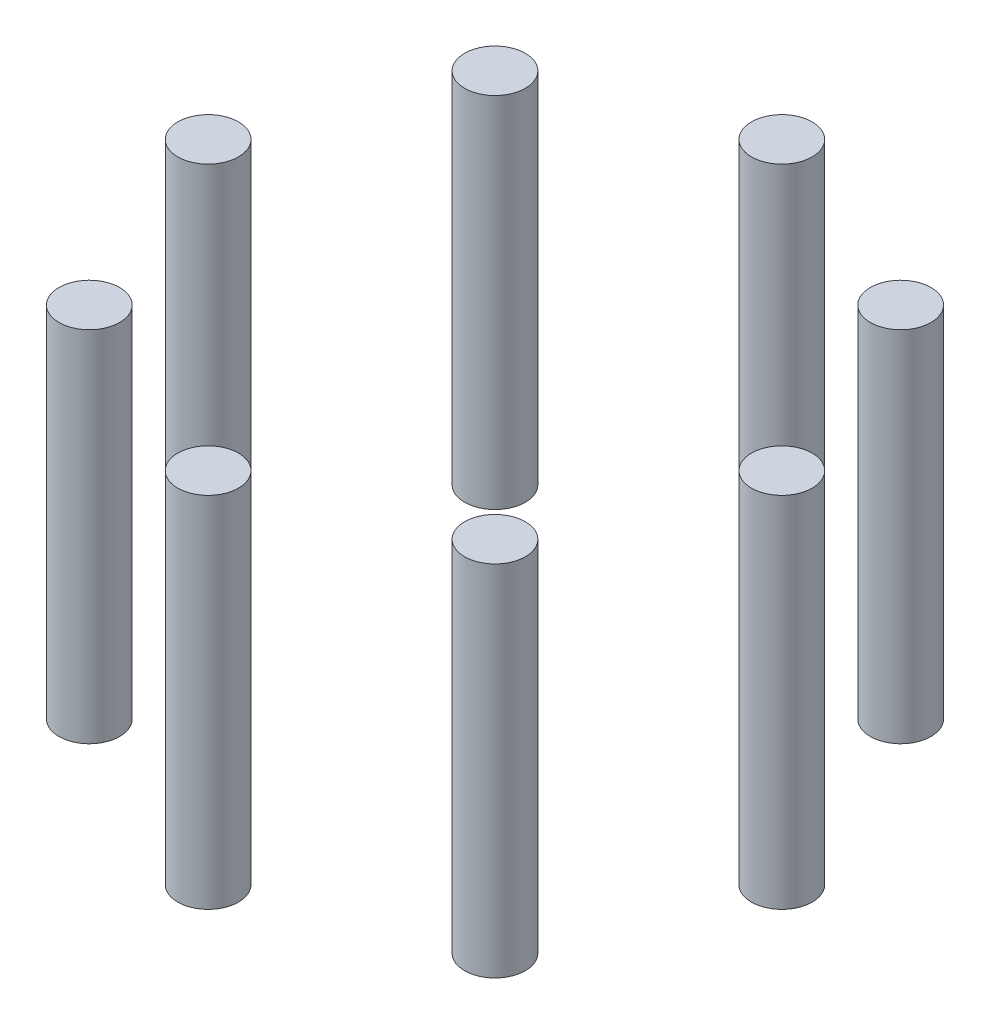
ISO-10303-21;
HEADER;
FILE_DESCRIPTION(('STEP AP214'),'2;1');
FILE_NAME('part.step','',(''),(''),'','','');
FILE_SCHEMA(('AUTOMOTIVE_DESIGN { 1 0 10303 214 1 1 1 1 }'));
ENDSEC;
DATA;
#1=APPLICATION_CONTEXT('core data for automotive mechanical design processes');
#2=APPLICATION_PROTOCOL_DEFINITION('international standard','automotive_design',2000,#1);
#3=PRODUCT_CONTEXT('',#1,'mechanical');
#4=PRODUCT('Part','Part','',(#3));
#5=PRODUCT_RELATED_PRODUCT_CATEGORY('part','',(#4));
#6=PRODUCT_DEFINITION_FORMATION('','',#4);
#7=PRODUCT_DEFINITION_CONTEXT('part definition',#1,'design');
#8=PRODUCT_DEFINITION('design','',#6,#7);
#9=PRODUCT_DEFINITION_SHAPE('','',#8);
#10=(LENGTH_UNIT() NAMED_UNIT(*) SI_UNIT(.MILLI.,.METRE.));
#11=(NAMED_UNIT(*) PLANE_ANGLE_UNIT() SI_UNIT($,.RADIAN.));
#12=(NAMED_UNIT(*) SI_UNIT($,.STERADIAN.) SOLID_ANGLE_UNIT());
#13=UNCERTAINTY_MEASURE_WITH_UNIT(LENGTH_MEASURE(1.E-05),#10,'distance_accuracy_value','');
#14=(GEOMETRIC_REPRESENTATION_CONTEXT(3) GLOBAL_UNCERTAINTY_ASSIGNED_CONTEXT((#13)) GLOBAL_UNIT_ASSIGNED_CONTEXT((#10,
#11,#12)) REPRESENTATION_CONTEXT('',''));
#15=CARTESIAN_POINT('',(0.,0.,0.));
#16=DIRECTION('',(0.,0.,1.));
#17=DIRECTION('',(1.,0.,0.));
#18=AXIS2_PLACEMENT_3D('',#15,#16,#17);
#19=CARTESIAN_POINT('',(-5.44671088859529E-13,65.,52.));
#20=DIRECTION('',(0.,-1.,0.));
#21=DIRECTION('',(0.,0.,-1.));
#22=AXIS2_PLACEMENT_3D('',#19,#20,#21);
#23=CYLINDRICAL_SURFACE('',#22,5.49999999999999);
#24=CARTESIAN_POINT('',(-5.44671088859529E-13,65.,52.));
#25=DIRECTION('',(0.,1.,0.));
#26=DIRECTION('',(0.,0.,1.));
#27=AXIS2_PLACEMENT_3D('',#24,#25,#26);
#28=CIRCLE('',#27,5.49999999999999);
#29=CARTESIAN_POINT('',(-5.44671088859529E-13,65.,57.5));
#30=VERTEX_POINT('',#29);
#31=EDGE_CURVE('E48',#30,#30,#28,.T.);
#32=ORIENTED_EDGE('',*,*,#31,.F.);
#33=EDGE_LOOP('',(#32));
#34=FACE_BOUND('',#33,.T.);
#35=CARTESIAN_POINT('',(-5.44671088859529E-13,0.,52.));
#36=DIRECTION('',(0.,1.,0.));
#37=DIRECTION('',(0.,0.,1.));
#38=AXIS2_PLACEMENT_3D('',#35,#36,#37);
#39=CIRCLE('',#38,5.49999999999999);
#40=CARTESIAN_POINT('',(-5.44671088859529E-13,0.,57.5));
#41=VERTEX_POINT('',#40);
#42=EDGE_CURVE('E11',#41,#41,#39,.T.);
#43=ORIENTED_EDGE('',*,*,#42,.T.);
#44=EDGE_LOOP('',(#43));
#45=FACE_BOUND('',#44,.T.);
#46=ADVANCED_FACE('F44',(#34,#45),#23,.T.);
#47=CARTESIAN_POINT('',(-5.44671088859529E-13,65.,52.));
#48=DIRECTION('',(0.,1.,0.));
#49=DIRECTION('',(0.,0.,1.));
#50=AXIS2_PLACEMENT_3D('',#47,#48,#49);
#51=PLANE('',#50);
#52=ORIENTED_EDGE('',*,*,#31,.T.);
#53=EDGE_LOOP('',(#52));
#54=FACE_BOUND('',#53,.T.);
#55=ADVANCED_FACE('F46',(#54),#51,.T.);
#56=CARTESIAN_POINT('',(-5.44671088859529E-13,0.,52.));
#57=DIRECTION('',(0.,1.,0.));
#58=DIRECTION('',(0.,0.,1.));
#59=AXIS2_PLACEMENT_3D('',#56,#57,#58);
#60=PLANE('',#59);
#61=ORIENTED_EDGE('',*,*,#42,.F.);
#62=EDGE_LOOP('',(#61));
#63=FACE_BOUND('',#62,.T.);
#64=ADVANCED_FACE('F63',(#63),#60,.F.);
#65=CLOSED_SHELL('',(#46,#55,#64));
#66=MANIFOLD_SOLID_BREP('B2',#65);
#67=CARTESIAN_POINT('',(36.7695526217001,65.,36.7695526217008));
#68=DIRECTION('',(0.,-1.,0.));
#69=DIRECTION('',(0.,0.,-1.));
#70=AXIS2_PLACEMENT_3D('',#67,#68,#69);
#71=CYLINDRICAL_SURFACE('',#70,5.49999999999999);
#72=CARTESIAN_POINT('',(36.7695526217001,65.,36.7695526217008));
#73=DIRECTION('',(0.,1.,0.));
#74=DIRECTION('',(0.,0.,1.));
#75=AXIS2_PLACEMENT_3D('',#72,#73,#74);
#76=CIRCLE('',#75,5.49999999999999);
#77=CARTESIAN_POINT('',(36.7695526217001,65.,42.2695526217008));
#78=VERTEX_POINT('',#77);
#79=EDGE_CURVE('E103',#78,#78,#76,.T.);
#80=ORIENTED_EDGE('',*,*,#79,.F.);
#81=EDGE_LOOP('',(#80));
#82=FACE_BOUND('',#81,.T.);
#83=CARTESIAN_POINT('',(36.7695526217001,0.,36.7695526217008));
#84=DIRECTION('',(0.,1.,0.));
#85=DIRECTION('',(0.,0.,1.));
#86=AXIS2_PLACEMENT_3D('',#83,#84,#85);
#87=CIRCLE('',#86,5.49999999999999);
#88=CARTESIAN_POINT('',(36.7695526217001,0.,42.2695526217008));
#89=VERTEX_POINT('',#88);
#90=EDGE_CURVE('E43',#89,#89,#87,.T.);
#91=ORIENTED_EDGE('',*,*,#90,.T.);
#92=EDGE_LOOP('',(#91));
#93=FACE_BOUND('',#92,.T.);
#94=ADVANCED_FACE('F99',(#82,#93),#71,.T.);
#95=CARTESIAN_POINT('',(36.7695526217001,65.,36.7695526217008));
#96=DIRECTION('',(0.,1.,0.));
#97=DIRECTION('',(0.,0.,1.));
#98=AXIS2_PLACEMENT_3D('',#95,#96,#97);
#99=PLANE('',#98);
#100=ORIENTED_EDGE('',*,*,#79,.T.);
#101=EDGE_LOOP('',(#100));
#102=FACE_BOUND('',#101,.T.);
#103=ADVANCED_FACE('F101',(#102),#99,.T.);
#104=CARTESIAN_POINT('',(36.7695526217001,0.,36.7695526217008));
#105=DIRECTION('',(0.,1.,0.));
#106=DIRECTION('',(0.,0.,1.));
#107=AXIS2_PLACEMENT_3D('',#104,#105,#106);
#108=PLANE('',#107);
#109=ORIENTED_EDGE('',*,*,#90,.F.);
#110=EDGE_LOOP('',(#109));
#111=FACE_BOUND('',#110,.T.);
#112=ADVANCED_FACE('F118',(#111),#108,.F.);
#113=CLOSED_SHELL('',(#94,#103,#112));
#114=MANIFOLD_SOLID_BREP('B6',#113);
#115=CARTESIAN_POINT('',(52.,65.,3.63114059239686E-13));
#116=DIRECTION('',(0.,-1.,0.));
#117=DIRECTION('',(0.,0.,-1.));
#118=AXIS2_PLACEMENT_3D('',#115,#116,#117);
#119=CYLINDRICAL_SURFACE('',#118,5.5);
#120=CARTESIAN_POINT('',(52.,65.,3.63114059239686E-13));
#121=DIRECTION('',(0.,1.,0.));
#122=DIRECTION('',(0.,0.,1.));
#123=AXIS2_PLACEMENT_3D('',#120,#121,#122);
#124=CIRCLE('',#123,5.5);
#125=CARTESIAN_POINT('',(52.,65.,5.50000000000036));
#126=VERTEX_POINT('',#125);
#127=EDGE_CURVE('E158',#126,#126,#124,.T.);
#128=ORIENTED_EDGE('',*,*,#127,.F.);
#129=EDGE_LOOP('',(#128));
#130=FACE_BOUND('',#129,.T.);
#131=CARTESIAN_POINT('',(52.,0.,3.63114059239686E-13));
#132=DIRECTION('',(0.,1.,0.));
#133=DIRECTION('',(0.,0.,1.));
#134=AXIS2_PLACEMENT_3D('',#131,#132,#133);
#135=CIRCLE('',#134,5.5);
#136=CARTESIAN_POINT('',(52.,0.,5.50000000000036));
#137=VERTEX_POINT('',#136);
#138=EDGE_CURVE('E98',#137,#137,#135,.T.);
#139=ORIENTED_EDGE('',*,*,#138,.T.);
#140=EDGE_LOOP('',(#139));
#141=FACE_BOUND('',#140,.T.);
#142=ADVANCED_FACE('F154',(#130,#141),#119,.T.);
#143=CARTESIAN_POINT('',(52.,65.,3.63114059239686E-13));
#144=DIRECTION('',(0.,1.,0.));
#145=DIRECTION('',(0.,0.,1.));
#146=AXIS2_PLACEMENT_3D('',#143,#144,#145);
#147=PLANE('',#146);
#148=ORIENTED_EDGE('',*,*,#127,.T.);
#149=EDGE_LOOP('',(#148));
#150=FACE_BOUND('',#149,.T.);
#151=ADVANCED_FACE('F156',(#150),#147,.T.);
#152=CARTESIAN_POINT('',(52.,0.,3.63114059239686E-13));
#153=DIRECTION('',(0.,1.,0.));
#154=DIRECTION('',(0.,0.,1.));
#155=AXIS2_PLACEMENT_3D('',#152,#153,#154);
#156=PLANE('',#155);
#157=ORIENTED_EDGE('',*,*,#138,.F.);
#158=EDGE_LOOP('',(#157));
#159=FACE_BOUND('',#158,.T.);
#160=ADVANCED_FACE('F173',(#159),#156,.F.);
#161=CLOSED_SHELL('',(#142,#151,#160));
#162=MANIFOLD_SOLID_BREP('B38',#161);
#163=CARTESIAN_POINT('',(36.7695526217007,65.,-36.7695526217003));
#164=DIRECTION('',(0.,-1.,0.));
#165=DIRECTION('',(0.,0.,-1.));
#166=AXIS2_PLACEMENT_3D('',#163,#164,#165);
#167=CYLINDRICAL_SURFACE('',#166,5.49999999999999);
#168=CARTESIAN_POINT('',(36.7695526217007,65.,-36.7695526217003));
#169=DIRECTION('',(0.,1.,0.));
#170=DIRECTION('',(0.,0.,1.));
#171=AXIS2_PLACEMENT_3D('',#168,#169,#170);
#172=CIRCLE('',#171,5.49999999999999);
#173=CARTESIAN_POINT('',(36.7695526217007,65.,-31.2695526217003));
#174=VERTEX_POINT('',#173);
#175=EDGE_CURVE('E213',#174,#174,#172,.T.);
#176=ORIENTED_EDGE('',*,*,#175,.F.);
#177=EDGE_LOOP('',(#176));
#178=FACE_BOUND('',#177,.T.);
#179=CARTESIAN_POINT('',(36.7695526217007,0.,-36.7695526217003));
#180=DIRECTION('',(0.,1.,0.));
#181=DIRECTION('',(0.,0.,1.));
#182=AXIS2_PLACEMENT_3D('',#179,#180,#181);
#183=CIRCLE('',#182,5.49999999999999);
#184=CARTESIAN_POINT('',(36.7695526217007,0.,-31.2695526217003));
#185=VERTEX_POINT('',#184);
#186=EDGE_CURVE('E153',#185,#185,#183,.T.);
#187=ORIENTED_EDGE('',*,*,#186,.T.);
#188=EDGE_LOOP('',(#187));
#189=FACE_BOUND('',#188,.T.);
#190=ADVANCED_FACE('F209',(#178,#189),#167,.T.);
#191=CARTESIAN_POINT('',(36.7695526217007,65.,-36.7695526217003));
#192=DIRECTION('',(0.,1.,0.));
#193=DIRECTION('',(0.,0.,1.));
#194=AXIS2_PLACEMENT_3D('',#191,#192,#193);
#195=PLANE('',#194);
#196=ORIENTED_EDGE('',*,*,#175,.T.);
#197=EDGE_LOOP('',(#196));
#198=FACE_BOUND('',#197,.T.);
#199=ADVANCED_FACE('F211',(#198),#195,.T.);
#200=CARTESIAN_POINT('',(36.7695526217007,0.,-36.7695526217003));
#201=DIRECTION('',(0.,1.,0.));
#202=DIRECTION('',(0.,0.,1.));
#203=AXIS2_PLACEMENT_3D('',#200,#201,#202);
#204=PLANE('',#203);
#205=ORIENTED_EDGE('',*,*,#186,.F.);
#206=EDGE_LOOP('',(#205));
#207=FACE_BOUND('',#206,.T.);
#208=ADVANCED_FACE('F228',(#207),#204,.F.);
#209=CLOSED_SHELL('',(#190,#199,#208));
#210=MANIFOLD_SOLID_BREP('B93',#209);
#211=CARTESIAN_POINT('',(1.81557029619843E-13,65.,-52.));
#212=DIRECTION('',(0.,-1.,0.));
#213=DIRECTION('',(0.,0.,-1.));
#214=AXIS2_PLACEMENT_3D('',#211,#212,#213);
#215=CYLINDRICAL_SURFACE('',#214,5.5);
#216=CARTESIAN_POINT('',(1.81557029619843E-13,65.,-52.));
#217=DIRECTION('',(0.,1.,0.));
#218=DIRECTION('',(0.,0.,1.));
#219=AXIS2_PLACEMENT_3D('',#216,#217,#218);
#220=CIRCLE('',#219,5.5);
#221=CARTESIAN_POINT('',(1.81557029619843E-13,65.,-46.5));
#222=VERTEX_POINT('',#221);
#223=EDGE_CURVE('E268',#222,#222,#220,.T.);
#224=ORIENTED_EDGE('',*,*,#223,.F.);
#225=EDGE_LOOP('',(#224));
#226=FACE_BOUND('',#225,.T.);
#227=CARTESIAN_POINT('',(1.81557029619843E-13,0.,-52.));
#228=DIRECTION('',(0.,1.,0.));
#229=DIRECTION('',(0.,0.,1.));
#230=AXIS2_PLACEMENT_3D('',#227,#228,#229);
#231=CIRCLE('',#230,5.5);
#232=CARTESIAN_POINT('',(1.81557029619843E-13,0.,-46.5));
#233=VERTEX_POINT('',#232);
#234=EDGE_CURVE('E208',#233,#233,#231,.T.);
#235=ORIENTED_EDGE('',*,*,#234,.T.);
#236=EDGE_LOOP('',(#235));
#237=FACE_BOUND('',#236,.T.);
#238=ADVANCED_FACE('F264',(#226,#237),#215,.T.);
#239=CARTESIAN_POINT('',(1.81557029619843E-13,65.,-52.));
#240=DIRECTION('',(0.,1.,0.));
#241=DIRECTION('',(0.,0.,1.));
#242=AXIS2_PLACEMENT_3D('',#239,#240,#241);
#243=PLANE('',#242);
#244=ORIENTED_EDGE('',*,*,#223,.T.);
#245=EDGE_LOOP('',(#244));
#246=FACE_BOUND('',#245,.T.);
#247=ADVANCED_FACE('F266',(#246),#243,.T.);
#248=CARTESIAN_POINT('',(1.81557029619843E-13,0.,-52.));
#249=DIRECTION('',(0.,1.,0.));
#250=DIRECTION('',(0.,0.,1.));
#251=AXIS2_PLACEMENT_3D('',#248,#249,#250);
#252=PLANE('',#251);
#253=ORIENTED_EDGE('',*,*,#234,.F.);
#254=EDGE_LOOP('',(#253));
#255=FACE_BOUND('',#254,.T.);
#256=ADVANCED_FACE('F283',(#255),#252,.F.);
#257=CLOSED_SHELL('',(#238,#247,#256));
#258=MANIFOLD_SOLID_BREP('B148',#257);
#259=CARTESIAN_POINT('',(-36.7695526217004,65.,-36.7695526217005));
#260=DIRECTION('',(0.,-1.,0.));
#261=DIRECTION('',(0.,0.,-1.));
#262=AXIS2_PLACEMENT_3D('',#259,#260,#261);
#263=CYLINDRICAL_SURFACE('',#262,5.5);
#264=CARTESIAN_POINT('',(-36.7695526217004,65.,-36.7695526217005));
#265=DIRECTION('',(0.,1.,0.));
#266=DIRECTION('',(0.,0.,1.));
#267=AXIS2_PLACEMENT_3D('',#264,#265,#266);
#268=CIRCLE('',#267,5.5);
#269=CARTESIAN_POINT('',(-36.7695526217004,65.,-31.2695526217006));
#270=VERTEX_POINT('',#269);
#271=EDGE_CURVE('E323',#270,#270,#268,.T.);
#272=ORIENTED_EDGE('',*,*,#271,.F.);
#273=EDGE_LOOP('',(#272));
#274=FACE_BOUND('',#273,.T.);
#275=CARTESIAN_POINT('',(-36.7695526217004,0.,-36.7695526217005));
#276=DIRECTION('',(0.,1.,0.));
#277=DIRECTION('',(0.,0.,1.));
#278=AXIS2_PLACEMENT_3D('',#275,#276,#277);
#279=CIRCLE('',#278,5.5);
#280=CARTESIAN_POINT('',(-36.7695526217004,0.,-31.2695526217006));
#281=VERTEX_POINT('',#280);
#282=EDGE_CURVE('E263',#281,#281,#279,.T.);
#283=ORIENTED_EDGE('',*,*,#282,.T.);
#284=EDGE_LOOP('',(#283));
#285=FACE_BOUND('',#284,.T.);
#286=ADVANCED_FACE('F319',(#274,#285),#263,.T.);
#287=CARTESIAN_POINT('',(-36.7695526217004,65.,-36.7695526217005));
#288=DIRECTION('',(0.,1.,0.));
#289=DIRECTION('',(0.,0.,1.));
#290=AXIS2_PLACEMENT_3D('',#287,#288,#289);
#291=PLANE('',#290);
#292=ORIENTED_EDGE('',*,*,#271,.T.);
#293=EDGE_LOOP('',(#292));
#294=FACE_BOUND('',#293,.T.);
#295=ADVANCED_FACE('F321',(#294),#291,.T.);
#296=CARTESIAN_POINT('',(-36.7695526217004,0.,-36.7695526217005));
#297=DIRECTION('',(0.,1.,0.));
#298=DIRECTION('',(0.,0.,1.));
#299=AXIS2_PLACEMENT_3D('',#296,#297,#298);
#300=PLANE('',#299);
#301=ORIENTED_EDGE('',*,*,#282,.F.);
#302=EDGE_LOOP('',(#301));
#303=FACE_BOUND('',#302,.T.);
#304=ADVANCED_FACE('F338',(#303),#300,.F.);
#305=CLOSED_SHELL('',(#286,#295,#304));
#306=MANIFOLD_SOLID_BREP('B203',#305);
#307=CARTESIAN_POINT('',(-36.7695526217009,65.,36.7695526217));
#308=DIRECTION('',(0.,-1.,0.));
#309=DIRECTION('',(0.,0.,-1.));
#310=AXIS2_PLACEMENT_3D('',#307,#308,#309);
#311=CYLINDRICAL_SURFACE('',#310,5.5);
#312=CARTESIAN_POINT('',(-36.7695526217009,65.,36.7695526217));
#313=DIRECTION('',(0.,1.,0.));
#314=DIRECTION('',(0.,0.,1.));
#315=AXIS2_PLACEMENT_3D('',#312,#313,#314);
#316=CIRCLE('',#315,5.5);
#317=CARTESIAN_POINT('',(-36.7695526217009,65.,42.2695526217));
#318=VERTEX_POINT('',#317);
#319=EDGE_CURVE('E377',#318,#318,#316,.T.);
#320=ORIENTED_EDGE('',*,*,#319,.F.);
#321=EDGE_LOOP('',(#320));
#322=FACE_BOUND('',#321,.T.);
#323=CARTESIAN_POINT('',(-36.7695526217009,0.,36.7695526217));
#324=DIRECTION('',(0.,1.,0.));
#325=DIRECTION('',(0.,0.,1.));
#326=AXIS2_PLACEMENT_3D('',#323,#324,#325);
#327=CIRCLE('',#326,5.5);
#328=CARTESIAN_POINT('',(-36.7695526217009,0.,42.2695526217));
#329=VERTEX_POINT('',#328);
#330=EDGE_CURVE('E318',#329,#329,#327,.T.);
#331=ORIENTED_EDGE('',*,*,#330,.T.);
#332=EDGE_LOOP('',(#331));
#333=FACE_BOUND('',#332,.T.);
#334=ADVANCED_FACE('F373',(#322,#333),#311,.T.);
#335=CARTESIAN_POINT('',(-36.7695526217009,65.,36.7695526217));
#336=DIRECTION('',(0.,1.,0.));
#337=DIRECTION('',(0.,0.,1.));
#338=AXIS2_PLACEMENT_3D('',#335,#336,#337);
#339=PLANE('',#338);
#340=ORIENTED_EDGE('',*,*,#319,.T.);
#341=EDGE_LOOP('',(#340));
#342=FACE_BOUND('',#341,.T.);
#343=ADVANCED_FACE('F375',(#342),#339,.T.);
#344=CARTESIAN_POINT('',(-36.7695526217009,0.,36.7695526217));
#345=DIRECTION('',(0.,1.,0.));
#346=DIRECTION('',(0.,0.,1.));
#347=AXIS2_PLACEMENT_3D('',#344,#345,#346);
#348=PLANE('',#347);
#349=ORIENTED_EDGE('',*,*,#330,.F.);
#350=EDGE_LOOP('',(#349));
#351=FACE_BOUND('',#350,.T.);
#352=ADVANCED_FACE('F392',(#351),#348,.F.);
#353=CLOSED_SHELL('',(#334,#343,#352));
#354=MANIFOLD_SOLID_BREP('B258',#353);
#355=CARTESIAN_POINT('',(-52.,65.,0.));
#356=DIRECTION('',(0.,-1.,0.));
#357=DIRECTION('',(0.,0.,-1.));
#358=AXIS2_PLACEMENT_3D('',#355,#356,#357);
#359=CYLINDRICAL_SURFACE('',#358,5.5);
#360=CARTESIAN_POINT('',(-52.,65.,0.));
#361=DIRECTION('',(0.,1.,0.));
#362=DIRECTION('',(0.,0.,1.));
#363=AXIS2_PLACEMENT_3D('',#360,#361,#362);
#364=CIRCLE('',#363,5.5);
#365=CARTESIAN_POINT('',(-52.,65.,5.5));
#366=VERTEX_POINT('',#365);
#367=EDGE_CURVE('E372',#366,#366,#364,.T.);
#368=ORIENTED_EDGE('',*,*,#367,.F.);
#369=EDGE_LOOP('',(#368));
#370=FACE_BOUND('',#369,.T.);
#371=CARTESIAN_POINT('',(-52.,0.,0.));
#372=DIRECTION('',(0.,1.,0.));
#373=DIRECTION('',(0.,0.,1.));
#374=AXIS2_PLACEMENT_3D('',#371,#372,#373);
#375=CIRCLE('',#374,5.5);
#376=CARTESIAN_POINT('',(-52.,0.,5.5));
#377=VERTEX_POINT('',#376);
#378=EDGE_CURVE('E423',#377,#377,#375,.T.);
#379=ORIENTED_EDGE('',*,*,#378,.T.);
#380=EDGE_LOOP('',(#379));
#381=FACE_BOUND('',#380,.T.);
#382=ADVANCED_FACE('F420',(#370,#381),#359,.T.);
#383=CARTESIAN_POINT('',(-52.,65.,0.));
#384=DIRECTION('',(0.,1.,0.));
#385=DIRECTION('',(0.,0.,1.));
#386=AXIS2_PLACEMENT_3D('',#383,#384,#385);
#387=PLANE('',#386);
#388=ORIENTED_EDGE('',*,*,#367,.T.);
#389=EDGE_LOOP('',(#388));
#390=FACE_BOUND('',#389,.T.);
#391=ADVANCED_FACE('F435',(#390),#387,.T.);
#392=CARTESIAN_POINT('',(-52.,0.,0.));
#393=DIRECTION('',(0.,1.,0.));
#394=DIRECTION('',(0.,0.,1.));
#395=AXIS2_PLACEMENT_3D('',#392,#393,#394);
#396=PLANE('',#395);
#397=ORIENTED_EDGE('',*,*,#378,.F.);
#398=EDGE_LOOP('',(#397));
#399=FACE_BOUND('',#398,.T.);
#400=ADVANCED_FACE('F433',(#399),#396,.F.);
#401=CLOSED_SHELL('',(#382,#391,#400));
#402=MANIFOLD_SOLID_BREP('B313',#401);
#403=ADVANCED_BREP_SHAPE_REPRESENTATION('',(#18,#66,#114,#162,#210,#258,#306,#354,#402),#14);
#404=SHAPE_DEFINITION_REPRESENTATION(#9,#403);
ENDSEC;
END-ISO-10303-21;
